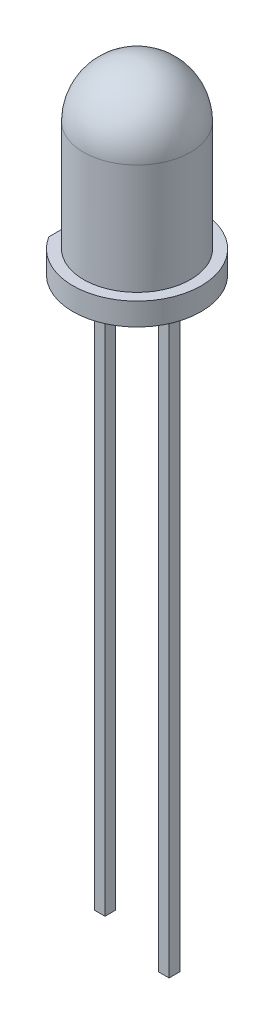
ISO-10303-21;
HEADER;
FILE_DESCRIPTION(('STEP AP214'),'2;1');
FILE_NAME('part.step','',(''),(''),'','','');
FILE_SCHEMA(('AUTOMOTIVE_DESIGN { 1 0 10303 214 1 1 1 1 }'));
ENDSEC;
DATA;
#1=APPLICATION_CONTEXT('core data for automotive mechanical design processes');
#2=APPLICATION_PROTOCOL_DEFINITION('international standard','automotive_design',2000,#1);
#3=PRODUCT_CONTEXT('',#1,'mechanical');
#4=PRODUCT('Part','Part','',(#3));
#5=PRODUCT_RELATED_PRODUCT_CATEGORY('part','',(#4));
#6=PRODUCT_DEFINITION_FORMATION('','',#4);
#7=PRODUCT_DEFINITION_CONTEXT('part definition',#1,'design');
#8=PRODUCT_DEFINITION('design','',#6,#7);
#9=PRODUCT_DEFINITION_SHAPE('','',#8);
#10=(LENGTH_UNIT() NAMED_UNIT(*) SI_UNIT(.MILLI.,.METRE.));
#11=(NAMED_UNIT(*) PLANE_ANGLE_UNIT() SI_UNIT($,.RADIAN.));
#12=(NAMED_UNIT(*) SI_UNIT($,.STERADIAN.) SOLID_ANGLE_UNIT());
#13=UNCERTAINTY_MEASURE_WITH_UNIT(LENGTH_MEASURE(1.E-05),#10,'distance_accuracy_value','');
#14=(GEOMETRIC_REPRESENTATION_CONTEXT(3) GLOBAL_UNCERTAINTY_ASSIGNED_CONTEXT((#13)) GLOBAL_UNIT_ASSIGNED_CONTEXT((#10,
#11,#12)) REPRESENTATION_CONTEXT('',''));
#15=CARTESIAN_POINT('',(0.,0.,0.));
#16=DIRECTION('',(0.,0.,1.));
#17=DIRECTION('',(1.,0.,0.));
#18=AXIS2_PLACEMENT_3D('',#15,#16,#17);
#19=CARTESIAN_POINT('',(0.,0.,0.));
#20=DIRECTION('',(0.,1.,0.));
#21=DIRECTION('',(-1.,0.,0.));
#22=AXIS2_PLACEMENT_3D('',#19,#20,#21);
#23=PLANE('',#22);
#24=DIRECTION('',(0.,0.,-1.));
#25=VECTOR('',#24,1.);
#26=CARTESIAN_POINT('',(-1.75,0.,0.25));
#27=LINE('',#26,#25);
#28=CARTESIAN_POINT('',(-1.75,0.,0.25));
#29=VERTEX_POINT('',#28);
#30=CARTESIAN_POINT('',(-1.75,0.,-0.25));
#31=VERTEX_POINT('',#30);
#32=EDGE_CURVE('E205',#29,#31,#27,.T.);
#33=ORIENTED_EDGE('',*,*,#32,.F.);
#34=DIRECTION('',(-1.,0.,0.));
#35=VECTOR('',#34,1.);
#36=CARTESIAN_POINT('',(-1.75,0.,0.25));
#37=LINE('',#36,#35);
#38=CARTESIAN_POINT('',(-1.25,0.,0.25));
#39=VERTEX_POINT('',#38);
#40=EDGE_CURVE('E128',#39,#29,#37,.T.);
#41=ORIENTED_EDGE('',*,*,#40,.F.);
#42=DIRECTION('',(0.,0.,1.));
#43=VECTOR('',#42,1.);
#44=CARTESIAN_POINT('',(-1.25,0.,0.25));
#45=LINE('',#44,#43);
#46=CARTESIAN_POINT('',(-1.25,0.,-0.25));
#47=VERTEX_POINT('',#46);
#48=EDGE_CURVE('E133',#47,#39,#45,.T.);
#49=ORIENTED_EDGE('',*,*,#48,.F.);
#50=DIRECTION('',(1.,0.,0.));
#51=VECTOR('',#50,1.);
#52=CARTESIAN_POINT('',(-1.75,0.,-0.25));
#53=LINE('',#52,#51);
#54=EDGE_CURVE('E207',#31,#47,#53,.T.);
#55=ORIENTED_EDGE('',*,*,#54,.F.);
#56=EDGE_LOOP('',(#33,#41,#49,#55));
#57=FACE_BOUND('',#56,.T.);
#58=CARTESIAN_POINT('',(0.,0.,0.));
#59=DIRECTION('',(0.,1.,0.));
#60=DIRECTION('',(-1.,0.,0.));
#61=AXIS2_PLACEMENT_3D('',#58,#59,#60);
#62=CIRCLE('',#61,3.);
#63=CARTESIAN_POINT('',(-2.55,0.,1.58034806292792));
#64=VERTEX_POINT('',#63);
#65=CARTESIAN_POINT('',(-2.55,0.,-1.58034806292792));
#66=VERTEX_POINT('',#65);
#67=EDGE_CURVE('E156',#64,#66,#62,.T.);
#68=ORIENTED_EDGE('',*,*,#67,.F.);
#69=DIRECTION('',(0.,0.,1.));
#70=VECTOR('',#69,1.);
#71=CARTESIAN_POINT('',(-2.55,0.,2.68749571470313));
#72=LINE('',#71,#70);
#73=EDGE_CURVE('E139',#66,#64,#72,.T.);
#74=ORIENTED_EDGE('',*,*,#73,.F.);
#75=EDGE_LOOP('',(#68,#74));
#76=FACE_BOUND('',#75,.T.);
#77=DIRECTION('',(-1.,0.,0.));
#78=VECTOR('',#77,1.);
#79=CARTESIAN_POINT('',(1.75,0.,0.25));
#80=LINE('',#79,#78);
#81=CARTESIAN_POINT('',(1.75,0.,0.25));
#82=VERTEX_POINT('',#81);
#83=CARTESIAN_POINT('',(1.25,0.,0.25));
#84=VERTEX_POINT('',#83);
#85=EDGE_CURVE('E122',#82,#84,#80,.T.);
#86=ORIENTED_EDGE('',*,*,#85,.F.);
#87=DIRECTION('',(0.,0.,1.));
#88=VECTOR('',#87,1.);
#89=CARTESIAN_POINT('',(1.75,0.,0.25));
#90=LINE('',#89,#88);
#91=CARTESIAN_POINT('',(1.75,0.,-0.25));
#92=VERTEX_POINT('',#91);
#93=EDGE_CURVE('E173',#92,#82,#90,.T.);
#94=ORIENTED_EDGE('',*,*,#93,.F.);
#95=DIRECTION('',(1.,0.,0.));
#96=VECTOR('',#95,1.);
#97=CARTESIAN_POINT('',(1.75,0.,-0.25));
#98=LINE('',#97,#96);
#99=CARTESIAN_POINT('',(1.25,0.,-0.25));
#100=VERTEX_POINT('',#99);
#101=EDGE_CURVE('E189',#100,#92,#98,.T.);
#102=ORIENTED_EDGE('',*,*,#101,.F.);
#103=DIRECTION('',(0.,0.,-1.));
#104=VECTOR('',#103,1.);
#105=CARTESIAN_POINT('',(1.25,0.,0.25));
#106=LINE('',#105,#104);
#107=EDGE_CURVE('E57',#84,#100,#106,.T.);
#108=ORIENTED_EDGE('',*,*,#107,.F.);
#109=EDGE_LOOP('',(#86,#94,#102,#108));
#110=FACE_BOUND('',#109,.T.);
#111=ADVANCED_FACE('F36',(#57,#76,#110),#23,.F.);
#112=CARTESIAN_POINT('',(0.,6.21,0.));
#113=DIRECTION('',(0.,1.,0.));
#114=DIRECTION('',(-1.,0.,0.));
#115=AXIS2_PLACEMENT_3D('',#112,#113,#114);
#116=CYLINDRICAL_SURFACE('',#115,3.);
#117=ORIENTED_EDGE('',*,*,#67,.T.);
#118=DIRECTION('',(0.,1.,0.));
#119=VECTOR('',#118,1.);
#120=CARTESIAN_POINT('',(-2.55,6.21,-1.58034806292792));
#121=LINE('',#120,#119);
#122=CARTESIAN_POINT('',(-2.55,1.05,-1.58034806292792));
#123=VERTEX_POINT('',#122);
#124=EDGE_CURVE('E144',#66,#123,#121,.T.);
#125=ORIENTED_EDGE('',*,*,#124,.T.);
#126=CARTESIAN_POINT('',(0.,1.05,0.));
#127=DIRECTION('',(0.,1.,0.));
#128=DIRECTION('',(-1.,0.,0.));
#129=AXIS2_PLACEMENT_3D('',#126,#127,#128);
#130=CIRCLE('',#129,3.);
#131=CARTESIAN_POINT('',(-2.55,1.05,1.58034806292792));
#132=VERTEX_POINT('',#131);
#133=EDGE_CURVE('E153',#132,#123,#130,.T.);
#134=ORIENTED_EDGE('',*,*,#133,.F.);
#135=DIRECTION('',(0.,1.,0.));
#136=VECTOR('',#135,1.);
#137=CARTESIAN_POINT('',(-2.55,6.21,1.58034806292792));
#138=LINE('',#137,#136);
#139=EDGE_CURVE('E141',#132,#64,#138,.F.);
#140=ORIENTED_EDGE('',*,*,#139,.T.);
#141=EDGE_LOOP('',(#117,#125,#134,#140));
#142=FACE_BOUND('',#141,.T.);
#143=ADVANCED_FACE('F164',(#142),#116,.T.);
#144=CARTESIAN_POINT('',(3.,1.05,0.));
#145=DIRECTION('',(0.,-1.,0.));
#146=DIRECTION('',(1.,0.,0.));
#147=AXIS2_PLACEMENT_3D('',#144,#145,#146);
#148=PLANE('',#147);
#149=CARTESIAN_POINT('',(0.,1.05,0.));
#150=DIRECTION('',(0.,1.,0.));
#151=DIRECTION('',(-1.,0.,0.));
#152=AXIS2_PLACEMENT_3D('',#149,#150,#151);
#153=CIRCLE('',#152,2.5);
#154=CARTESIAN_POINT('',(-2.5,1.05,0.));
#155=VERTEX_POINT('',#154);
#156=EDGE_CURVE('E150',#155,#155,#153,.T.);
#157=ORIENTED_EDGE('',*,*,#156,.F.);
#158=EDGE_LOOP('',(#157));
#159=FACE_BOUND('',#158,.T.);
#160=ORIENTED_EDGE('',*,*,#133,.T.);
#161=DIRECTION('',(0.,0.,1.));
#162=VECTOR('',#161,1.);
#163=CARTESIAN_POINT('',(-2.55,1.05,0.));
#164=LINE('',#163,#162);
#165=EDGE_CURVE('E43',#123,#132,#164,.T.);
#166=ORIENTED_EDGE('',*,*,#165,.T.);
#167=EDGE_LOOP('',(#160,#166));
#168=FACE_BOUND('',#167,.T.);
#169=ADVANCED_FACE('F161',(#159,#168),#148,.F.);
#170=CARTESIAN_POINT('',(0.,6.21,0.));
#171=DIRECTION('',(0.,1.,0.));
#172=DIRECTION('',(-1.,0.,0.));
#173=AXIS2_PLACEMENT_3D('',#170,#171,#172);
#174=CYLINDRICAL_SURFACE('',#173,2.5);
#175=CARTESIAN_POINT('',(0.,6.21,0.));
#176=DIRECTION('',(0.,1.,0.));
#177=DIRECTION('',(-1.,0.,0.));
#178=AXIS2_PLACEMENT_3D('',#175,#176,#177);
#179=CIRCLE('',#178,2.5);
#180=CARTESIAN_POINT('',(-2.5,6.21,0.));
#181=VERTEX_POINT('',#180);
#182=EDGE_CURVE('E147',#181,#181,#179,.T.);
#183=ORIENTED_EDGE('',*,*,#182,.F.);
#184=EDGE_LOOP('',(#183));
#185=FACE_BOUND('',#184,.T.);
#186=ORIENTED_EDGE('',*,*,#156,.T.);
#187=EDGE_LOOP('',(#186));
#188=FACE_BOUND('',#187,.T.);
#189=ADVANCED_FACE('F260',(#185,#188),#174,.T.);
#190=CARTESIAN_POINT('',(0.,6.21,0.));
#191=DIRECTION('',(0.,1.,0.));
#192=DIRECTION('',(1.,0.,0.));
#193=AXIS2_PLACEMENT_3D('',#190,#191,#192);
#194=SPHERICAL_SURFACE('',#193,2.5);
#195=ORIENTED_EDGE('',*,*,#182,.T.);
#196=EDGE_LOOP('',(#195));
#197=FACE_BOUND('',#196,.T.);
#198=ADVANCED_FACE('F257',(#197),#194,.T.);
#199=CARTESIAN_POINT('',(-2.55,10.,2.68749571470313));
#200=DIRECTION('',(1.,0.,0.));
#201=DIRECTION('',(0.,0.,-1.));
#202=AXIS2_PLACEMENT_3D('',#199,#200,#201);
#203=PLANE('',#202);
#204=ORIENTED_EDGE('',*,*,#73,.T.);
#205=ORIENTED_EDGE('',*,*,#139,.F.);
#206=ORIENTED_EDGE('',*,*,#165,.F.);
#207=ORIENTED_EDGE('',*,*,#124,.F.);
#208=EDGE_LOOP('',(#204,#205,#206,#207));
#209=FACE_BOUND('',#208,.T.);
#210=ADVANCED_FACE('F167',(#209),#203,.F.);
#211=CARTESIAN_POINT('',(-1.75,-27.5,0.25));
#212=DIRECTION('',(1.,0.,0.));
#213=DIRECTION('',(0.,1.,0.));
#214=AXIS2_PLACEMENT_3D('',#211,#212,#213);
#215=PLANE('',#214);
#216=DIRECTION('',(0.,1.,0.));
#217=VECTOR('',#216,1.);
#218=CARTESIAN_POINT('',(-1.75,-27.5,-0.25));
#219=LINE('',#218,#217);
#220=CARTESIAN_POINT('',(-1.75,-26.5,-0.25));
#221=VERTEX_POINT('',#220);
#222=EDGE_CURVE('E121',#221,#31,#219,.T.);
#223=ORIENTED_EDGE('',*,*,#222,.F.);
#224=DIRECTION('',(0.,0.,1.));
#225=VECTOR('',#224,1.);
#226=CARTESIAN_POINT('',(-1.75,-26.5,0.25));
#227=LINE('',#226,#225);
#228=CARTESIAN_POINT('',(-1.75,-26.5,0.25));
#229=VERTEX_POINT('',#228);
#230=EDGE_CURVE('E110',#221,#229,#227,.T.);
#231=ORIENTED_EDGE('',*,*,#230,.T.);
#232=DIRECTION('',(0.,1.,0.));
#233=VECTOR('',#232,1.);
#234=CARTESIAN_POINT('',(-1.75,-27.5,0.25));
#235=LINE('',#234,#233);
#236=EDGE_CURVE('E119',#229,#29,#235,.T.);
#237=ORIENTED_EDGE('',*,*,#236,.T.);
#238=ORIENTED_EDGE('',*,*,#32,.T.);
#239=EDGE_LOOP('',(#223,#231,#237,#238));
#240=FACE_BOUND('',#239,.T.);
#241=ADVANCED_FACE('F117',(#240),#215,.F.);
#242=CARTESIAN_POINT('',(-1.75,-27.5,-0.25));
#243=DIRECTION('',(0.,0.,1.));
#244=DIRECTION('',(1.,0.,0.));
#245=AXIS2_PLACEMENT_3D('',#242,#243,#244);
#246=PLANE('',#245);
#247=DIRECTION('',(0.,1.,0.));
#248=VECTOR('',#247,1.);
#249=CARTESIAN_POINT('',(-1.25,-27.5,-0.25));
#250=LINE('',#249,#248);
#251=CARTESIAN_POINT('',(-1.25,-26.5,-0.25));
#252=VERTEX_POINT('',#251);
#253=EDGE_CURVE('E131',#252,#47,#250,.T.);
#254=ORIENTED_EDGE('',*,*,#253,.F.);
#255=DIRECTION('',(-1.,0.,0.));
#256=VECTOR('',#255,1.);
#257=CARTESIAN_POINT('',(-1.75,-26.5,-0.25));
#258=LINE('',#257,#256);
#259=EDGE_CURVE('E123',#252,#221,#258,.T.);
#260=ORIENTED_EDGE('',*,*,#259,.T.);
#261=ORIENTED_EDGE('',*,*,#222,.T.);
#262=ORIENTED_EDGE('',*,*,#54,.T.);
#263=EDGE_LOOP('',(#254,#260,#261,#262));
#264=FACE_BOUND('',#263,.T.);
#265=ADVANCED_FACE('F216',(#264),#246,.F.);
#266=CARTESIAN_POINT('',(-1.25,-27.5,0.25));
#267=DIRECTION('',(-1.,0.,0.));
#268=DIRECTION('',(0.,-1.,0.));
#269=AXIS2_PLACEMENT_3D('',#266,#267,#268);
#270=PLANE('',#269);
#271=DIRECTION('',(0.,1.,0.));
#272=VECTOR('',#271,1.);
#273=CARTESIAN_POINT('',(-1.25,-27.5,0.25));
#274=LINE('',#273,#272);
#275=CARTESIAN_POINT('',(-1.25,-26.5,0.25));
#276=VERTEX_POINT('',#275);
#277=EDGE_CURVE('E129',#276,#39,#274,.T.);
#278=ORIENTED_EDGE('',*,*,#277,.F.);
#279=DIRECTION('',(0.,0.,-1.));
#280=VECTOR('',#279,1.);
#281=CARTESIAN_POINT('',(-1.25,-26.5,0.25));
#282=LINE('',#281,#280);
#283=EDGE_CURVE('E50',#276,#252,#282,.T.);
#284=ORIENTED_EDGE('',*,*,#283,.T.);
#285=ORIENTED_EDGE('',*,*,#253,.T.);
#286=ORIENTED_EDGE('',*,*,#48,.T.);
#287=EDGE_LOOP('',(#278,#284,#285,#286));
#288=FACE_BOUND('',#287,.T.);
#289=ADVANCED_FACE('F212',(#288),#270,.F.);
#290=CARTESIAN_POINT('',(-1.75,-27.5,0.25));
#291=DIRECTION('',(0.,0.,-1.));
#292=DIRECTION('',(-1.,0.,0.));
#293=AXIS2_PLACEMENT_3D('',#290,#291,#292);
#294=PLANE('',#293);
#295=ORIENTED_EDGE('',*,*,#236,.F.);
#296=DIRECTION('',(1.,0.,0.));
#297=VECTOR('',#296,1.);
#298=CARTESIAN_POINT('',(-1.75,-26.5,0.25));
#299=LINE('',#298,#297);
#300=EDGE_CURVE('E11',#229,#276,#299,.T.);
#301=ORIENTED_EDGE('',*,*,#300,.T.);
#302=ORIENTED_EDGE('',*,*,#277,.T.);
#303=ORIENTED_EDGE('',*,*,#40,.T.);
#304=EDGE_LOOP('',(#295,#301,#302,#303));
#305=FACE_BOUND('',#304,.T.);
#306=ADVANCED_FACE('F126',(#305),#294,.F.);
#307=CARTESIAN_POINT('',(1.75,-27.5,0.25));
#308=DIRECTION('',(0.,0.,-1.));
#309=DIRECTION('',(-1.,0.,0.));
#310=AXIS2_PLACEMENT_3D('',#307,#308,#309);
#311=PLANE('',#310);
#312=ORIENTED_EDGE('',*,*,#85,.T.);
#313=DIRECTION('',(0.,1.,0.));
#314=VECTOR('',#313,1.);
#315=CARTESIAN_POINT('',(1.25,-27.5,0.25));
#316=LINE('',#315,#314);
#317=CARTESIAN_POINT('',(1.25,-27.5,0.25));
#318=VERTEX_POINT('',#317);
#319=EDGE_CURVE('E203',#318,#84,#316,.T.);
#320=ORIENTED_EDGE('',*,*,#319,.F.);
#321=DIRECTION('',(-1.,0.,0.));
#322=VECTOR('',#321,1.);
#323=CARTESIAN_POINT('',(1.75,-27.5,0.25));
#324=LINE('',#323,#322);
#325=CARTESIAN_POINT('',(1.75,-27.5,0.25));
#326=VERTEX_POINT('',#325);
#327=EDGE_CURVE('E188',#326,#318,#324,.T.);
#328=ORIENTED_EDGE('',*,*,#327,.F.);
#329=DIRECTION('',(0.,1.,0.));
#330=VECTOR('',#329,1.);
#331=CARTESIAN_POINT('',(1.75,-27.5,0.25));
#332=LINE('',#331,#330);
#333=EDGE_CURVE('E184',#326,#82,#332,.T.);
#334=ORIENTED_EDGE('',*,*,#333,.T.);
#335=EDGE_LOOP('',(#312,#320,#328,#334));
#336=FACE_BOUND('',#335,.T.);
#337=ADVANCED_FACE('F191',(#336),#311,.F.);
#338=CARTESIAN_POINT('',(1.25,-27.5,0.25));
#339=DIRECTION('',(1.,0.,0.));
#340=DIRECTION('',(0.,1.,0.));
#341=AXIS2_PLACEMENT_3D('',#338,#339,#340);
#342=PLANE('',#341);
#343=ORIENTED_EDGE('',*,*,#107,.T.);
#344=DIRECTION('',(0.,1.,0.));
#345=VECTOR('',#344,1.);
#346=CARTESIAN_POINT('',(1.25,-27.5,-0.25));
#347=LINE('',#346,#345);
#348=CARTESIAN_POINT('',(1.25,-27.5,-0.25));
#349=VERTEX_POINT('',#348);
#350=EDGE_CURVE('E195',#349,#100,#347,.T.);
#351=ORIENTED_EDGE('',*,*,#350,.F.);
#352=DIRECTION('',(0.,0.,-1.));
#353=VECTOR('',#352,1.);
#354=CARTESIAN_POINT('',(1.25,-27.5,0.25));
#355=LINE('',#354,#353);
#356=EDGE_CURVE('E221',#318,#349,#355,.T.);
#357=ORIENTED_EDGE('',*,*,#356,.F.);
#358=ORIENTED_EDGE('',*,*,#319,.T.);
#359=EDGE_LOOP('',(#343,#351,#357,#358));
#360=FACE_BOUND('',#359,.T.);
#361=ADVANCED_FACE('F229',(#360),#342,.F.);
#362=CARTESIAN_POINT('',(1.75,-27.5,-0.25));
#363=DIRECTION('',(0.,0.,1.));
#364=DIRECTION('',(1.,0.,0.));
#365=AXIS2_PLACEMENT_3D('',#362,#363,#364);
#366=PLANE('',#365);
#367=ORIENTED_EDGE('',*,*,#101,.T.);
#368=DIRECTION('',(0.,1.,0.));
#369=VECTOR('',#368,1.);
#370=CARTESIAN_POINT('',(1.75,-27.5,-0.25));
#371=LINE('',#370,#369);
#372=CARTESIAN_POINT('',(1.75,-27.5,-0.25));
#373=VERTEX_POINT('',#372);
#374=EDGE_CURVE('E187',#373,#92,#371,.T.);
#375=ORIENTED_EDGE('',*,*,#374,.F.);
#376=DIRECTION('',(1.,0.,0.));
#377=VECTOR('',#376,1.);
#378=CARTESIAN_POINT('',(1.75,-27.5,-0.25));
#379=LINE('',#378,#377);
#380=EDGE_CURVE('E197',#349,#373,#379,.T.);
#381=ORIENTED_EDGE('',*,*,#380,.F.);
#382=ORIENTED_EDGE('',*,*,#350,.T.);
#383=EDGE_LOOP('',(#367,#375,#381,#382));
#384=FACE_BOUND('',#383,.T.);
#385=ADVANCED_FACE('F225',(#384),#366,.F.);
#386=CARTESIAN_POINT('',(1.75,-27.5,0.25));
#387=DIRECTION('',(-1.,0.,0.));
#388=DIRECTION('',(0.,-1.,0.));
#389=AXIS2_PLACEMENT_3D('',#386,#387,#388);
#390=PLANE('',#389);
#391=ORIENTED_EDGE('',*,*,#93,.T.);
#392=ORIENTED_EDGE('',*,*,#333,.F.);
#393=DIRECTION('',(0.,0.,1.));
#394=VECTOR('',#393,1.);
#395=CARTESIAN_POINT('',(1.75,-27.5,0.25));
#396=LINE('',#395,#394);
#397=EDGE_CURVE('E193',#373,#326,#396,.T.);
#398=ORIENTED_EDGE('',*,*,#397,.F.);
#399=ORIENTED_EDGE('',*,*,#374,.T.);
#400=EDGE_LOOP('',(#391,#392,#398,#399));
#401=FACE_BOUND('',#400,.T.);
#402=ADVANCED_FACE('F182',(#401),#390,.F.);
#403=CARTESIAN_POINT('',(1.25,-27.5,0.25));
#404=DIRECTION('',(0.,-1.,0.));
#405=DIRECTION('',(1.,0.,0.));
#406=AXIS2_PLACEMENT_3D('',#403,#404,#405);
#407=PLANE('',#406);
#408=ORIENTED_EDGE('',*,*,#327,.T.);
#409=ORIENTED_EDGE('',*,*,#356,.T.);
#410=ORIENTED_EDGE('',*,*,#380,.T.);
#411=ORIENTED_EDGE('',*,*,#397,.T.);
#412=EDGE_LOOP('',(#408,#409,#410,#411));
#413=FACE_BOUND('',#412,.T.);
#414=ADVANCED_FACE('F231',(#413),#407,.T.);
#415=CARTESIAN_POINT('',(-5.26768699966318,-26.5,-13.75));
#416=DIRECTION('',(0.,1.,0.));
#417=DIRECTION('',(0.,0.,1.));
#418=AXIS2_PLACEMENT_3D('',#415,#416,#417);
#419=PLANE('',#418);
#420=ORIENTED_EDGE('',*,*,#259,.F.);
#421=ORIENTED_EDGE('',*,*,#283,.F.);
#422=ORIENTED_EDGE('',*,*,#300,.F.);
#423=ORIENTED_EDGE('',*,*,#230,.F.);
#424=EDGE_LOOP('',(#420,#421,#422,#423));
#425=FACE_BOUND('',#424,.T.);
#426=ADVANCED_FACE('F109',(#425),#419,.F.);
#427=CLOSED_SHELL('',(#111,#143,#169,#189,#198,#210,#241,#265,#289,#306,#337,#361,#385,#402,
#414,#426));
#428=MANIFOLD_SOLID_BREP('B2',#427);
#429=ADVANCED_BREP_SHAPE_REPRESENTATION('',(#18,#428),#14);
#430=SHAPE_DEFINITION_REPRESENTATION(#9,#429);
ENDSEC;
END-ISO-10303-21;
